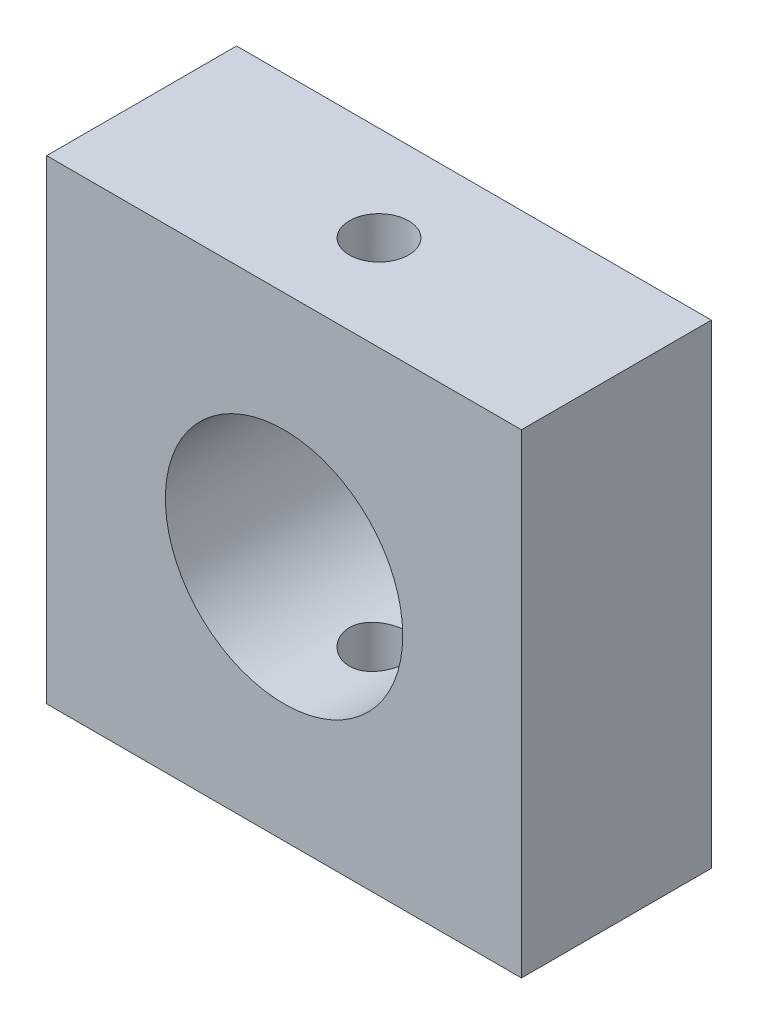
ISO-10303-21;
HEADER;
FILE_DESCRIPTION(('STEP AP214'),'2;1');
FILE_NAME('part.step','',(''),(''),'','','');
FILE_SCHEMA(('AUTOMOTIVE_DESIGN { 1 0 10303 214 1 1 1 1 }'));
ENDSEC;
DATA;
#1=APPLICATION_CONTEXT('core data for automotive mechanical design processes');
#2=APPLICATION_PROTOCOL_DEFINITION('international standard','automotive_design',2000,#1);
#3=PRODUCT_CONTEXT('',#1,'mechanical');
#4=PRODUCT('Part','Part','',(#3));
#5=PRODUCT_RELATED_PRODUCT_CATEGORY('part','',(#4));
#6=PRODUCT_DEFINITION_FORMATION('','',#4);
#7=PRODUCT_DEFINITION_CONTEXT('part definition',#1,'design');
#8=PRODUCT_DEFINITION('design','',#6,#7);
#9=PRODUCT_DEFINITION_SHAPE('','',#8);
#10=(LENGTH_UNIT() NAMED_UNIT(*) SI_UNIT(.MILLI.,.METRE.));
#11=(NAMED_UNIT(*) PLANE_ANGLE_UNIT() SI_UNIT($,.RADIAN.));
#12=(NAMED_UNIT(*) SI_UNIT($,.STERADIAN.) SOLID_ANGLE_UNIT());
#13=UNCERTAINTY_MEASURE_WITH_UNIT(LENGTH_MEASURE(1.E-05),#10,'distance_accuracy_value','');
#14=(GEOMETRIC_REPRESENTATION_CONTEXT(3) GLOBAL_UNCERTAINTY_ASSIGNED_CONTEXT((#13)) GLOBAL_UNIT_ASSIGNED_CONTEXT((#10,
#11,#12)) REPRESENTATION_CONTEXT('',''));
#15=CARTESIAN_POINT('',(0.,0.,0.));
#16=DIRECTION('',(0.,0.,1.));
#17=DIRECTION('',(1.,0.,0.));
#18=AXIS2_PLACEMENT_3D('',#15,#16,#17);
#19=CARTESIAN_POINT('',(0.,0.,8.));
#20=DIRECTION('',(0.,0.,1.));
#21=DIRECTION('',(1.,0.,0.));
#22=AXIS2_PLACEMENT_3D('',#19,#20,#21);
#23=PLANE('',#22);
#24=DIRECTION('',(0.,1.,0.));
#25=VECTOR('',#24,1.);
#26=CARTESIAN_POINT('',(60.,-40.,8.));
#27=LINE('',#26,#25);
#28=CARTESIAN_POINT('',(60.,-60.,8.));
#29=VERTEX_POINT('',#28);
#30=CARTESIAN_POINT('',(60.,-40.,8.));
#31=VERTEX_POINT('',#30);
#32=EDGE_CURVE('E92',#29,#31,#27,.T.);
#33=ORIENTED_EDGE('',*,*,#32,.T.);
#34=DIRECTION('',(-1.,0.,0.));
#35=VECTOR('',#34,1.);
#36=CARTESIAN_POINT('',(40.,-40.,8.));
#37=LINE('',#36,#35);
#38=CARTESIAN_POINT('',(40.,-40.,8.));
#39=VERTEX_POINT('',#38);
#40=EDGE_CURVE('E87',#31,#39,#37,.T.);
#41=ORIENTED_EDGE('',*,*,#40,.T.);
#42=DIRECTION('',(0.,-1.,0.));
#43=VECTOR('',#42,1.);
#44=CARTESIAN_POINT('',(40.,-40.,8.));
#45=LINE('',#44,#43);
#46=CARTESIAN_POINT('',(40.,-60.,8.));
#47=VERTEX_POINT('',#46);
#48=EDGE_CURVE('E90',#39,#47,#45,.T.);
#49=ORIENTED_EDGE('',*,*,#48,.T.);
#50=DIRECTION('',(1.,0.,0.));
#51=VECTOR('',#50,1.);
#52=CARTESIAN_POINT('',(40.,-60.,8.));
#53=LINE('',#52,#51);
#54=EDGE_CURVE('E57',#47,#29,#53,.T.);
#55=ORIENTED_EDGE('',*,*,#54,.T.);
#56=EDGE_LOOP('',(#33,#41,#49,#55));
#57=FACE_BOUND('',#56,.T.);
#58=CARTESIAN_POINT('',(50.,-50.,8.));
#59=DIRECTION('',(0.,0.,1.));
#60=DIRECTION('',(1.,0.,0.));
#61=AXIS2_PLACEMENT_3D('',#58,#59,#60);
#62=CIRCLE('',#61,5.);
#63=CARTESIAN_POINT('',(55.,-50.,8.));
#64=VERTEX_POINT('',#63);
#65=EDGE_CURVE('E108',#64,#64,#62,.T.);
#66=ORIENTED_EDGE('',*,*,#65,.F.);
#67=EDGE_LOOP('',(#66));
#68=FACE_BOUND('',#67,.T.);
#69=ADVANCED_FACE('F33',(#57,#68),#23,.T.);
#70=CARTESIAN_POINT('',(0.,0.,0.));
#71=DIRECTION('',(0.,0.,1.));
#72=DIRECTION('',(1.,0.,0.));
#73=AXIS2_PLACEMENT_3D('',#70,#71,#72);
#74=PLANE('',#73);
#75=DIRECTION('',(0.,1.,0.));
#76=VECTOR('',#75,1.);
#77=CARTESIAN_POINT('',(60.,-40.,0.));
#78=LINE('',#77,#76);
#79=CARTESIAN_POINT('',(60.,-60.,0.));
#80=VERTEX_POINT('',#79);
#81=CARTESIAN_POINT('',(60.,-40.,0.));
#82=VERTEX_POINT('',#81);
#83=EDGE_CURVE('E105',#80,#82,#78,.T.);
#84=ORIENTED_EDGE('',*,*,#83,.F.);
#85=DIRECTION('',(1.,0.,0.));
#86=VECTOR('',#85,1.);
#87=CARTESIAN_POINT('',(40.,-60.,0.));
#88=LINE('',#87,#86);
#89=CARTESIAN_POINT('',(40.,-60.,0.));
#90=VERTEX_POINT('',#89);
#91=EDGE_CURVE('E80',#90,#80,#88,.T.);
#92=ORIENTED_EDGE('',*,*,#91,.F.);
#93=DIRECTION('',(0.,-1.,0.));
#94=VECTOR('',#93,1.);
#95=CARTESIAN_POINT('',(40.,-40.,0.));
#96=LINE('',#95,#94);
#97=CARTESIAN_POINT('',(40.,-40.,0.));
#98=VERTEX_POINT('',#97);
#99=EDGE_CURVE('E74',#98,#90,#96,.T.);
#100=ORIENTED_EDGE('',*,*,#99,.F.);
#101=DIRECTION('',(-1.,0.,0.));
#102=VECTOR('',#101,1.);
#103=CARTESIAN_POINT('',(40.,-40.,0.));
#104=LINE('',#103,#102);
#105=EDGE_CURVE('E96',#82,#98,#104,.T.);
#106=ORIENTED_EDGE('',*,*,#105,.F.);
#107=EDGE_LOOP('',(#84,#92,#100,#106));
#108=FACE_BOUND('',#107,.T.);
#109=CARTESIAN_POINT('',(50.,-50.,0.));
#110=DIRECTION('',(0.,0.,1.));
#111=DIRECTION('',(1.,0.,0.));
#112=AXIS2_PLACEMENT_3D('',#109,#110,#111);
#113=CIRCLE('',#112,5.);
#114=CARTESIAN_POINT('',(55.,-50.,0.));
#115=VERTEX_POINT('',#114);
#116=EDGE_CURVE('E164',#115,#115,#113,.T.);
#117=ORIENTED_EDGE('',*,*,#116,.T.);
#118=EDGE_LOOP('',(#117));
#119=FACE_BOUND('',#118,.T.);
#120=ADVANCED_FACE('F137',(#108,#119),#74,.F.);
#121=CARTESIAN_POINT('',(60.,-40.,8.));
#122=DIRECTION('',(-1.,0.,0.));
#123=DIRECTION('',(0.,0.,1.));
#124=AXIS2_PLACEMENT_3D('',#121,#122,#123);
#125=PLANE('',#124);
#126=ORIENTED_EDGE('',*,*,#83,.T.);
#127=DIRECTION('',(0.,0.,-1.));
#128=VECTOR('',#127,1.);
#129=CARTESIAN_POINT('',(60.,-40.,8.));
#130=LINE('',#129,#128);
#131=EDGE_CURVE('E11',#31,#82,#130,.T.);
#132=ORIENTED_EDGE('',*,*,#131,.F.);
#133=ORIENTED_EDGE('',*,*,#32,.F.);
#134=DIRECTION('',(0.,0.,-1.));
#135=VECTOR('',#134,1.);
#136=CARTESIAN_POINT('',(60.,-60.,8.));
#137=LINE('',#136,#135);
#138=EDGE_CURVE('E101',#29,#80,#137,.T.);
#139=ORIENTED_EDGE('',*,*,#138,.T.);
#140=EDGE_LOOP('',(#126,#132,#133,#139));
#141=FACE_BOUND('',#140,.T.);
#142=ADVANCED_FACE('F35',(#141),#125,.F.);
#143=CARTESIAN_POINT('',(40.,-40.,8.));
#144=DIRECTION('',(0.,-1.,0.));
#145=DIRECTION('',(0.,0.,-1.));
#146=AXIS2_PLACEMENT_3D('',#143,#144,#145);
#147=PLANE('',#146);
#148=CARTESIAN_POINT('',(50.,-40.,4.));
#149=DIRECTION('',(0.,-1.,0.));
#150=DIRECTION('',(0.,0.,-1.));
#151=AXIS2_PLACEMENT_3D('',#148,#149,#150);
#152=CIRCLE('',#151,1.25);
#153=CARTESIAN_POINT('',(50.,-40.,2.75));
#154=VERTEX_POINT('',#153);
#155=EDGE_CURVE('E118',#154,#154,#152,.T.);
#156=ORIENTED_EDGE('',*,*,#155,.T.);
#157=EDGE_LOOP('',(#156));
#158=FACE_BOUND('',#157,.T.);
#159=ORIENTED_EDGE('',*,*,#105,.T.);
#160=DIRECTION('',(0.,0.,-1.));
#161=VECTOR('',#160,1.);
#162=CARTESIAN_POINT('',(40.,-40.,8.));
#163=LINE('',#162,#161);
#164=EDGE_CURVE('E48',#39,#98,#163,.T.);
#165=ORIENTED_EDGE('',*,*,#164,.F.);
#166=ORIENTED_EDGE('',*,*,#40,.F.);
#167=ORIENTED_EDGE('',*,*,#131,.T.);
#168=EDGE_LOOP('',(#159,#165,#166,#167));
#169=FACE_BOUND('',#168,.T.);
#170=ADVANCED_FACE('F95',(#158,#169),#147,.F.);
#171=CARTESIAN_POINT('',(40.,-40.,8.));
#172=DIRECTION('',(1.,0.,0.));
#173=DIRECTION('',(0.,0.,-1.));
#174=AXIS2_PLACEMENT_3D('',#171,#172,#173);
#175=PLANE('',#174);
#176=ORIENTED_EDGE('',*,*,#99,.T.);
#177=DIRECTION('',(0.,0.,-1.));
#178=VECTOR('',#177,1.);
#179=CARTESIAN_POINT('',(40.,-60.,8.));
#180=LINE('',#179,#178);
#181=EDGE_CURVE('E97',#47,#90,#180,.T.);
#182=ORIENTED_EDGE('',*,*,#181,.F.);
#183=ORIENTED_EDGE('',*,*,#48,.F.);
#184=ORIENTED_EDGE('',*,*,#164,.T.);
#185=EDGE_LOOP('',(#176,#182,#183,#184));
#186=FACE_BOUND('',#185,.T.);
#187=ADVANCED_FACE('F99',(#186),#175,.F.);
#188=CARTESIAN_POINT('',(40.,-60.,8.));
#189=DIRECTION('',(0.,1.,0.));
#190=DIRECTION('',(0.,0.,1.));
#191=AXIS2_PLACEMENT_3D('',#188,#189,#190);
#192=PLANE('',#191);
#193=CARTESIAN_POINT('',(50.,-60.,4.));
#194=DIRECTION('',(0.,-1.,0.));
#195=DIRECTION('',(0.,0.,-1.));
#196=AXIS2_PLACEMENT_3D('',#193,#194,#195);
#197=CIRCLE('',#196,1.25);
#198=CARTESIAN_POINT('',(50.,-60.,2.75));
#199=VERTEX_POINT('',#198);
#200=EDGE_CURVE('E157',#199,#199,#197,.T.);
#201=ORIENTED_EDGE('',*,*,#200,.F.);
#202=EDGE_LOOP('',(#201));
#203=FACE_BOUND('',#202,.T.);
#204=ORIENTED_EDGE('',*,*,#91,.T.);
#205=ORIENTED_EDGE('',*,*,#138,.F.);
#206=ORIENTED_EDGE('',*,*,#54,.F.);
#207=ORIENTED_EDGE('',*,*,#181,.T.);
#208=EDGE_LOOP('',(#204,#205,#206,#207));
#209=FACE_BOUND('',#208,.T.);
#210=ADVANCED_FACE('F133',(#203,#209),#192,.F.);
#211=CARTESIAN_POINT('',(50.,-50.,8.));
#212=DIRECTION('',(0.,0.,-1.));
#213=DIRECTION('',(-1.,0.,0.));
#214=AXIS2_PLACEMENT_3D('',#211,#212,#213);
#215=CYLINDRICAL_SURFACE('',#214,5.);
#216=CARTESIAN_POINT('',(50.,-45.,2.75));
#217=CARTESIAN_POINT('',(50.0690634072248,-45.0000011677666,2.75000193811513));
#218=CARTESIAN_POINT('',(50.138148464859,-45.0014451822348,2.75574295897816));
#219=CARTESIAN_POINT('',(50.2743386031421,-45.0070657180842,2.77852095942251));
#220=CARTESIAN_POINT('',(50.3414425390589,-45.0112437881669,2.79556434128154));
#221=CARTESIAN_POINT('',(50.4716840601521,-45.0218697805663,2.84036604455174));
#222=CARTESIAN_POINT('',(50.5348263028583,-45.028314976316,2.8681114989294));
#223=CARTESIAN_POINT('',(50.6555601099204,-45.0427888016034,2.93348449170403));
#224=CARTESIAN_POINT('',(50.7131514869573,-45.0508174845496,2.97111236343245));
#225=CARTESIAN_POINT('',(50.8223349394174,-45.0677715534017,3.05600065804517));
#226=CARTESIAN_POINT('',(50.8737964083842,-45.0767107737622,3.10342631246598));
#227=CARTESIAN_POINT('',(50.9681241060028,-45.0943864990206,3.20621017075743));
#228=CARTESIAN_POINT('',(51.0109893641243,-45.1031229809304,3.26156926912208));
#229=CARTESIAN_POINT('',(51.0875221189992,-45.1195435358358,3.37966268894786));
#230=CARTESIAN_POINT('',(51.1210435132711,-45.1272100460783,3.44249435900866));
#231=CARTESIAN_POINT('',(51.1769974237921,-45.1404208765648,3.57312367638196));
#232=CARTESIAN_POINT('',(51.1994317128661,-45.1459655360601,3.64092052777146));
#233=CARTESIAN_POINT('',(51.2321290306702,-45.1541626940204,3.77811958183539));
#234=CARTESIAN_POINT('',(51.2426268902778,-45.1568709077048,3.84746241337482));
#235=CARTESIAN_POINT('',(51.2518848125565,-45.1592553121855,3.98697380751164));
#236=CARTESIAN_POINT('',(51.2506467848483,-45.1589319962613,4.0571422339155));
#237=CARTESIAN_POINT('',(51.2366554371994,-45.1553399541949,4.1945131731204));
#238=CARTESIAN_POINT('',(51.2241819501588,-45.1521428083177,4.26174635122091));
#239=CARTESIAN_POINT('',(51.1885201557526,-45.1432774193626,4.39313420909274));
#240=CARTESIAN_POINT('',(51.1653310850579,-45.1376090002442,4.45728866919081));
#241=CARTESIAN_POINT('',(51.108657898281,-45.1243740507985,4.58144834687672));
#242=CARTESIAN_POINT('',(51.0750722226941,-45.1167889377548,4.64140514315796));
#243=CARTESIAN_POINT('',(50.9986302300125,-45.1005857429468,4.75493225813069));
#244=CARTESIAN_POINT('',(50.955772290674,-45.0919674805439,4.80850145672271));
#245=CARTESIAN_POINT('',(50.860552853901,-45.0743676621685,4.90933634641199));
#246=CARTESIAN_POINT('',(50.8079552151382,-45.0653827543503,4.95637874171779));
#247=CARTESIAN_POINT('',(50.6955099312531,-45.0482836201768,5.04101770205325));
#248=CARTESIAN_POINT('',(50.6356620647566,-45.0401694204215,5.07861397855297));
#249=CARTESIAN_POINT('',(50.5100965739012,-45.0256855658818,5.14337548852032));
#250=CARTESIAN_POINT('',(50.4443594943405,-45.0193219989356,5.17050445021202));
#251=CARTESIAN_POINT('',(50.3090633401191,-45.0091006917382,5.21326442142464));
#252=CARTESIAN_POINT('',(50.2395049992921,-45.0052424721727,5.22889763034845));
#253=CARTESIAN_POINT('',(50.100449975325,-45.0005375060719,5.24788130463236));
#254=CARTESIAN_POINT('',(50.0309972666568,-44.9996162207644,5.25153585506275));
#255=CARTESIAN_POINT('',(49.8924726043321,-45.0006766265463,5.24729249828709));
#256=CARTESIAN_POINT('',(49.8234006169629,-45.002658056318,5.23939563100072));
#257=CARTESIAN_POINT('',(49.6886547760196,-45.0092534906054,5.21252424300718));
#258=CARTESIAN_POINT('',(49.6229457341927,-45.0138280484516,5.19371561376918));
#259=CARTESIAN_POINT('',(49.4956189229563,-45.0250941113822,5.14574409664296));
#260=CARTESIAN_POINT('',(49.4340015674728,-45.0317858302509,5.11658016307236));
#261=CARTESIAN_POINT('',(49.3153973879751,-45.0467224339474,5.04813655927106));
#262=CARTESIAN_POINT('',(49.2585121318035,-45.0549927719422,5.0086865730027));
#263=CARTESIAN_POINT('',(49.1520611552973,-45.0721290901048,4.92100840933586));
#264=CARTESIAN_POINT('',(49.1024967008558,-45.0809951729025,4.87277871698591));
#265=CARTESIAN_POINT('',(49.0108411932727,-45.0985920253269,4.76749836596295));
#266=CARTESIAN_POINT('',(48.9689634436483,-45.1073141317727,4.71026024749798));
#267=CARTESIAN_POINT('',(48.8954077008228,-45.1233926801897,4.58938947127857));
#268=CARTESIAN_POINT('',(48.8637292548684,-45.1307491827748,4.52575709753354));
#269=CARTESIAN_POINT('',(48.8117071494923,-45.1431825438778,4.39424523132244));
#270=CARTESIAN_POINT('',(48.7912963361216,-45.1482728725675,4.32639364304666));
#271=CARTESIAN_POINT('',(48.7622119500385,-45.1556104659151,4.18807530175908));
#272=CARTESIAN_POINT('',(48.7535358104345,-45.1578583523339,4.1176091241396));
#273=CARTESIAN_POINT('',(48.7483011747217,-45.1592091566337,3.97823248012067));
#274=CARTESIAN_POINT('',(48.7514017518499,-45.1584005605978,3.9093354707294));
#275=CARTESIAN_POINT('',(48.7688522680726,-45.1539340916013,3.77308009277669));
#276=CARTESIAN_POINT('',(48.7832019810944,-45.1502762759012,3.70572169332196));
#277=CARTESIAN_POINT('',(48.8225572337977,-45.140572827644,3.57482628411217));
#278=CARTESIAN_POINT('',(48.847498829433,-45.1345415396974,3.51126891229983));
#279=CARTESIAN_POINT('',(48.9072792386624,-45.1207687022931,3.38919551440526));
#280=CARTESIAN_POINT('',(48.9421194249715,-45.1130269156602,3.33068018901091));
#281=CARTESIAN_POINT('',(49.0217768761357,-45.0964530478041,3.21870447583165));
#282=CARTESIAN_POINT('',(49.0668306975731,-45.0875977930687,3.16541577214671));
#283=CARTESIAN_POINT('',(49.1651755240086,-45.069933106281,3.06704412933717));
#284=CARTESIAN_POINT('',(49.2184684822824,-45.0611236856078,3.02196314157253));
#285=CARTESIAN_POINT('',(49.3329436777478,-45.0443528696028,2.94049057619617));
#286=CARTESIAN_POINT('',(49.3942513147363,-45.0364097219511,2.90427115527369));
#287=CARTESIAN_POINT('',(49.5222782837413,-45.0224589585407,2.84271044754956));
#288=CARTESIAN_POINT('',(49.588993697136,-45.0164499566685,2.81736136612622));
#289=CARTESIAN_POINT('',(49.7129914556304,-45.0079328369538,2.78202347472529));
#290=CARTESIAN_POINT('',(49.7696831909099,-45.0049784578943,2.77004063078881));
#291=CARTESIAN_POINT('',(49.8842449403864,-45.0010116230671,2.75402838031505));
#292=CARTESIAN_POINT('',(49.9421148656312,-44.9999990212426,2.74999837557892));
#293=CARTESIAN_POINT('',(50.,-45.,2.75));
#294=B_SPLINE_CURVE_WITH_KNOTS('',3,(#216,#217,#218,#219,#220,#221,#222,#223,#224,#225,#226,
#227,#228,#229,#230,#231,#232,#233,#234,#235,#236,#237,#238,#239,#240,#241,#242,#243,#244,#245,
#246,#247,#248,#249,#250,#251,#252,#253,#254,#255,#256,#257,#258,#259,#260,#261,#262,#263,#264,
#265,#266,#267,#268,#269,#270,#271,#272,#273,#274,#275,#276,#277,#278,#279,#280,#281,#282,#283,
#284,#285,#286,#287,#288,#289,#290,#291,#292,#293),.UNSPECIFIED.,.T.,.F.,(4,2,2,2,2,2,2,2,2,2,2,
2,2,2,2,2,2,2,2,2,2,2,2,2,2,2,2,2,2,2,2,2,2,2,2,2,2,2,4),(0.,0.206978093726568,
0.414073531469911,0.620920751905084,0.827774950141102,1.03845362864282,1.24915607983384,
1.46298872954838,1.67678717641139,1.88630245916191,2.09578365093913,2.30018747505847,
2.50460586221698,2.71108773228232,2.91760575696801,3.13001250807515,3.34242574631871,
3.55556857507594,3.76867061407201,3.97631924124395,4.1839491759395,4.38850228761695,
4.59307606101907,4.80127989637792,5.00951969173347,5.22287091003728,5.43621265624589,
5.64826878845029,5.86027852710338,6.06619816998842,6.2721136746336,6.47680333799537,
6.68152140114082,6.8915798034159,7.10168808142012,7.31560154582987,7.52936136517789,
7.70285202451788,7.87632963369198),.UNSPECIFIED.);
#295=CARTESIAN_POINT('',(50.,-45.,2.75));
#296=VERTEX_POINT('',#295);
#297=EDGE_CURVE('E37',#296,#296,#294,.T.);
#298=ORIENTED_EDGE('',*,*,#297,.F.);
#299=EDGE_LOOP('',(#298));
#300=FACE_BOUND('',#299,.T.);
#301=CARTESIAN_POINT('',(50.,-55.,2.75));
#302=CARTESIAN_POINT('',(49.9309365927752,-54.9999988322334,2.75000193811513));
#303=CARTESIAN_POINT('',(49.861851535141,-54.9985548177652,2.75574295897816));
#304=CARTESIAN_POINT('',(49.7256613968579,-54.9929342819158,2.77852095942251));
#305=CARTESIAN_POINT('',(49.6585574609411,-54.9887562118331,2.79556434128154));
#306=CARTESIAN_POINT('',(49.5283159398479,-54.9781302194337,2.84036604455174));
#307=CARTESIAN_POINT('',(49.4651736971417,-54.9716850236841,2.8681114989294));
#308=CARTESIAN_POINT('',(49.3444398900797,-54.9572111983966,2.93348449170403));
#309=CARTESIAN_POINT('',(49.2868485130427,-54.9491825154504,2.97111236343245));
#310=CARTESIAN_POINT('',(49.1776650605826,-54.9322284465984,3.05600065804518));
#311=CARTESIAN_POINT('',(49.1262035916158,-54.9232892262378,3.10342631246598));
#312=CARTESIAN_POINT('',(49.0318758939973,-54.9056135009794,3.20621017075743));
#313=CARTESIAN_POINT('',(48.9890106358757,-54.8968770190696,3.26156926912208));
#314=CARTESIAN_POINT('',(48.9124778810008,-54.8804564641642,3.37966268894786));
#315=CARTESIAN_POINT('',(48.8789564867289,-54.8727899539217,3.44249435900867));
#316=CARTESIAN_POINT('',(48.8230025762079,-54.8595791234352,3.57312367638196));
#317=CARTESIAN_POINT('',(48.8005682871339,-54.8540344639399,3.64092052777146));
#318=CARTESIAN_POINT('',(48.7678709693298,-54.8458373059796,3.77811958183539));
#319=CARTESIAN_POINT('',(48.7573731097222,-54.8431290922952,3.84746241337483));
#320=CARTESIAN_POINT('',(48.7481151874435,-54.8407446878145,3.98697380751164));
#321=CARTESIAN_POINT('',(48.7493532151517,-54.8410680037387,4.0571422339155));
#322=CARTESIAN_POINT('',(48.7633445628006,-54.8446600458052,4.1945131731204));
#323=CARTESIAN_POINT('',(48.7758180498412,-54.8478571916823,4.26174635122091));
#324=CARTESIAN_POINT('',(48.8114798442474,-54.8567225806374,4.39313420909274));
#325=CARTESIAN_POINT('',(48.8346689149422,-54.8623909997558,4.45728866919081));
#326=CARTESIAN_POINT('',(48.891342101719,-54.8756259492016,4.58144834687672));
#327=CARTESIAN_POINT('',(48.9249277773059,-54.8832110622452,4.64140514315796));
#328=CARTESIAN_POINT('',(49.0013697699875,-54.8994142570532,4.75493225813069));
#329=CARTESIAN_POINT('',(49.044227709326,-54.9080325194561,4.80850145672271));
#330=CARTESIAN_POINT('',(49.139447146099,-54.9256323378315,4.909336346412));
#331=CARTESIAN_POINT('',(49.1920447848618,-54.9346172456498,4.95637874171779));
#332=CARTESIAN_POINT('',(49.3044900687469,-54.9517163798232,5.04101770205325));
#333=CARTESIAN_POINT('',(49.3643379352434,-54.9598305795785,5.07861397855297));
#334=CARTESIAN_POINT('',(49.4899034260988,-54.9743144341182,5.14337548852032));
#335=CARTESIAN_POINT('',(49.5556405056595,-54.9806780010644,5.17050445021202));
#336=CARTESIAN_POINT('',(49.6909366598809,-54.9908993082618,5.21326442142464));
#337=CARTESIAN_POINT('',(49.7604950007079,-54.9947575278273,5.22889763034845));
#338=CARTESIAN_POINT('',(49.899550024675,-54.9994624939281,5.24788130463236));
#339=CARTESIAN_POINT('',(49.9690027333432,-55.0003837792357,5.25153585506275));
#340=CARTESIAN_POINT('',(50.1075273956679,-54.9993233734537,5.24729249828709));
#341=CARTESIAN_POINT('',(50.1765993830371,-54.997341943682,5.23939563100072));
#342=CARTESIAN_POINT('',(50.3113452239804,-54.9907465093946,5.21252424300718));
#343=CARTESIAN_POINT('',(50.3770542658073,-54.9861719515484,5.19371561376918));
#344=CARTESIAN_POINT('',(50.5043810770438,-54.9749058886178,5.14574409664296));
#345=CARTESIAN_POINT('',(50.5659984325272,-54.9682141697491,5.11658016307236));
#346=CARTESIAN_POINT('',(50.6846026120249,-54.9532775660526,5.04813655927106));
#347=CARTESIAN_POINT('',(50.7414878681965,-54.9450072280578,5.0086865730027));
#348=CARTESIAN_POINT('',(50.8479388447027,-54.9278709098952,4.92100840933586));
#349=CARTESIAN_POINT('',(50.8975032991442,-54.9190048270975,4.87277871698591));
#350=CARTESIAN_POINT('',(50.9891588067273,-54.9014079746731,4.76749836596295));
#351=CARTESIAN_POINT('',(51.0310365563517,-54.8926858682273,4.71026024749798));
#352=CARTESIAN_POINT('',(51.1045922991772,-54.8766073198103,4.58938947127857));
#353=CARTESIAN_POINT('',(51.1362707451316,-54.8692508172252,4.52575709753354));
#354=CARTESIAN_POINT('',(51.1882928505077,-54.8568174561222,4.39424523132244));
#355=CARTESIAN_POINT('',(51.2087036638784,-54.8517271274325,4.32639364304666));
#356=CARTESIAN_POINT('',(51.2377880499615,-54.8443895340849,4.18807530175908));
#357=CARTESIAN_POINT('',(51.2464641895656,-54.8421416476661,4.1176091241396));
#358=CARTESIAN_POINT('',(51.2516988252783,-54.8407908433663,3.97823248012067));
#359=CARTESIAN_POINT('',(51.2485982481501,-54.8415994394022,3.9093354707294));
#360=CARTESIAN_POINT('',(51.2311477319274,-54.8460659083987,3.77308009277669));
#361=CARTESIAN_POINT('',(51.2167980189056,-54.8497237240988,3.70572169332196));
#362=CARTESIAN_POINT('',(51.1774427662023,-54.859427172356,3.57482628411217));
#363=CARTESIAN_POINT('',(51.152501170567,-54.8654584603026,3.51126891229983));
#364=CARTESIAN_POINT('',(51.0927207613376,-54.8792312977069,3.38919551440526));
#365=CARTESIAN_POINT('',(51.0578805750285,-54.8869730843398,3.33068018901091));
#366=CARTESIAN_POINT('',(50.9782231238643,-54.9035469521959,3.21870447583166));
#367=CARTESIAN_POINT('',(50.9331693024269,-54.9124022069313,3.16541577214671));
#368=CARTESIAN_POINT('',(50.8348244759915,-54.930066893719,3.06704412933717));
#369=CARTESIAN_POINT('',(50.7815315177176,-54.9388763143922,3.02196314157253));
#370=CARTESIAN_POINT('',(50.6670563222522,-54.9556471303972,2.94049057619617));
#371=CARTESIAN_POINT('',(50.6057486852637,-54.9635902780489,2.90427115527369));
#372=CARTESIAN_POINT('',(50.4777217162587,-54.9775410414593,2.84271044754956));
#373=CARTESIAN_POINT('',(50.411006302864,-54.9835500433315,2.81736136612622));
#374=CARTESIAN_POINT('',(50.2870085443696,-54.9920671630462,2.78202347472529));
#375=CARTESIAN_POINT('',(50.2303168090901,-54.9950215421058,2.77004063078881));
#376=CARTESIAN_POINT('',(50.1157550596136,-54.9989883769329,2.75402838031505));
#377=CARTESIAN_POINT('',(50.0578851343689,-55.0000009787574,2.74999837557892));
#378=CARTESIAN_POINT('',(50.,-55.,2.75));
#379=B_SPLINE_CURVE_WITH_KNOTS('',3,(#301,#302,#303,#304,#305,#306,#307,#308,#309,#310,#311,
#312,#313,#314,#315,#316,#317,#318,#319,#320,#321,#322,#323,#324,#325,#326,#327,#328,#329,#330,
#331,#332,#333,#334,#335,#336,#337,#338,#339,#340,#341,#342,#343,#344,#345,#346,#347,#348,#349,
#350,#351,#352,#353,#354,#355,#356,#357,#358,#359,#360,#361,#362,#363,#364,#365,#366,#367,#368,
#369,#370,#371,#372,#373,#374,#375,#376,#377,#378),.UNSPECIFIED.,.T.,.F.,(4,2,2,2,2,2,2,2,2,2,2,
2,2,2,2,2,2,2,2,2,2,2,2,2,2,2,2,2,2,2,2,2,2,2,2,2,2,2,4),(0.,0.206978093726568,
0.414073531469911,0.620920751905084,0.827774950141102,1.03845362864283,1.24915607983384,
1.46298872954839,1.67678717641139,1.88630245916191,2.09578365093913,2.30018747505847,
2.50460586221698,2.71108773228232,2.91760575696801,3.13001250807516,3.34242574631872,
3.55556857507594,3.76867061407201,3.97631924124395,4.1839491759395,4.38850228761695,
4.59307606101907,4.80127989637791,5.00951969173347,5.22287091003728,5.43621265624589,
5.64826878845029,5.86027852710338,6.06619816998842,6.2721136746336,6.47680333799538,
6.68152140114082,6.89157980341589,7.10168808142013,7.31560154582988,7.52936136517789,
7.70285202451789,7.87632963369198),.UNSPECIFIED.);
#380=CARTESIAN_POINT('',(50.,-55.,2.75));
#381=VERTEX_POINT('',#380);
#382=EDGE_CURVE('E113',#381,#381,#379,.T.);
#383=ORIENTED_EDGE('',*,*,#382,.F.);
#384=EDGE_LOOP('',(#383));
#385=FACE_BOUND('',#384,.T.);
#386=ORIENTED_EDGE('',*,*,#65,.T.);
#387=EDGE_LOOP('',(#386));
#388=FACE_BOUND('',#387,.T.);
#389=ORIENTED_EDGE('',*,*,#116,.F.);
#390=EDGE_LOOP('',(#389));
#391=FACE_BOUND('',#390,.T.);
#392=ADVANCED_FACE('F119',(#300,#385,#388,#391),#215,.F.);
#393=CARTESIAN_POINT('',(50.,-40.,4.));
#394=DIRECTION('',(0.,-1.,0.));
#395=DIRECTION('',(0.,0.,-1.));
#396=AXIS2_PLACEMENT_3D('',#393,#394,#395);
#397=CYLINDRICAL_SURFACE('',#396,1.25);
#398=ORIENTED_EDGE('',*,*,#382,.T.);
#399=EDGE_LOOP('',(#398));
#400=FACE_BOUND('',#399,.T.);
#401=ORIENTED_EDGE('',*,*,#200,.T.);
#402=EDGE_LOOP('',(#401));
#403=FACE_BOUND('',#402,.T.);
#404=ADVANCED_FACE('F122',(#400,#403),#397,.F.);
#405=ORIENTED_EDGE('',*,*,#297,.T.);
#406=EDGE_LOOP('',(#405));
#407=FACE_BOUND('',#406,.T.);
#408=ORIENTED_EDGE('',*,*,#155,.F.);
#409=EDGE_LOOP('',(#408));
#410=FACE_BOUND('',#409,.T.);
#411=ADVANCED_FACE('F125',(#407,#410),#397,.F.);
#412=CLOSED_SHELL('',(#69,#120,#142,#170,#187,#210,#392,#404,#411));
#413=MANIFOLD_SOLID_BREP('B2',#412);
#414=ADVANCED_BREP_SHAPE_REPRESENTATION('',(#18,#413),#14);
#415=SHAPE_DEFINITION_REPRESENTATION(#9,#414);
ENDSEC;
END-ISO-10303-21;
